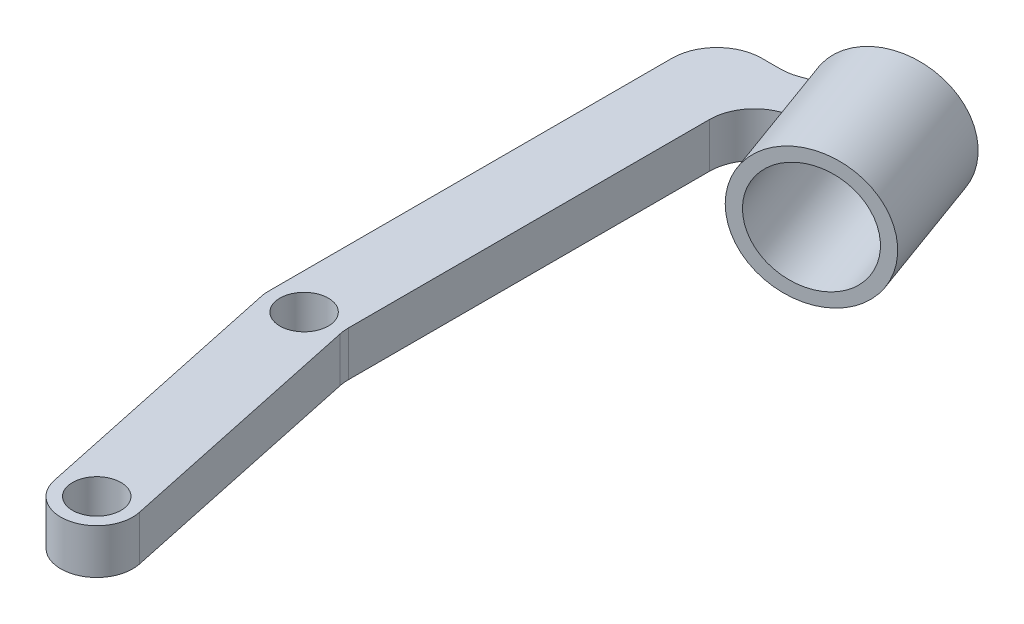
ISO-10303-21;
HEADER;
FILE_DESCRIPTION(('STEP AP214'),'2;1');
FILE_NAME('part.step','',(''),(''),'','','');
FILE_SCHEMA(('AUTOMOTIVE_DESIGN { 1 0 10303 214 1 1 1 1 }'));
ENDSEC;
DATA;
#1=APPLICATION_CONTEXT('core data for automotive mechanical design processes');
#2=APPLICATION_PROTOCOL_DEFINITION('international standard','automotive_design',2000,#1);
#3=PRODUCT_CONTEXT('',#1,'mechanical');
#4=PRODUCT('Part','Part','',(#3));
#5=PRODUCT_RELATED_PRODUCT_CATEGORY('part','',(#4));
#6=PRODUCT_DEFINITION_FORMATION('','',#4);
#7=PRODUCT_DEFINITION_CONTEXT('part definition',#1,'design');
#8=PRODUCT_DEFINITION('design','',#6,#7);
#9=PRODUCT_DEFINITION_SHAPE('','',#8);
#10=(LENGTH_UNIT() NAMED_UNIT(*) SI_UNIT(.MILLI.,.METRE.));
#11=(NAMED_UNIT(*) PLANE_ANGLE_UNIT() SI_UNIT($,.RADIAN.));
#12=(NAMED_UNIT(*) SI_UNIT($,.STERADIAN.) SOLID_ANGLE_UNIT());
#13=UNCERTAINTY_MEASURE_WITH_UNIT(LENGTH_MEASURE(1.E-05),#10,'distance_accuracy_value','');
#14=(GEOMETRIC_REPRESENTATION_CONTEXT(3) GLOBAL_UNCERTAINTY_ASSIGNED_CONTEXT((#13)) GLOBAL_UNIT_ASSIGNED_CONTEXT((#10,
#11,#12)) REPRESENTATION_CONTEXT('',''));
#15=CARTESIAN_POINT('',(0.,0.,0.));
#16=DIRECTION('',(0.,0.,1.));
#17=DIRECTION('',(1.,0.,0.));
#18=AXIS2_PLACEMENT_3D('',#15,#16,#17);
#19=CARTESIAN_POINT('',(-2.23735072453269,5.,-74.0235391596347));
#20=DIRECTION('',(-0.342020143325663,0.,-0.939692620785911));
#21=DIRECTION('',(-0.939692620785911,0.,0.342020143325663));
#22=AXIS2_PLACEMENT_3D('',#19,#20,#21);
#23=PLANE('',#22);
#24=DIRECTION('',(0.,-1.,0.));
#25=VECTOR('',#24,1.);
#26=CARTESIAN_POINT('',(1.05254855883899,0.,-75.2209645725156));
#27=LINE('',#26,#25);
#28=CARTESIAN_POINT('',(1.05254855883899,5.,-75.2209645725156));
#29=VERTEX_POINT('',#28);
#30=CARTESIAN_POINT('',(1.05254855883899,4.24621515844331,-75.2209645725156));
#31=VERTEX_POINT('',#30);
#32=EDGE_CURVE('E276',#29,#31,#27,.T.);
#33=ORIENTED_EDGE('',*,*,#32,.T.);
#34=CARTESIAN_POINT('',(7.90655681000694,2.5,-77.7156195613557));
#35=DIRECTION('',(-0.342020143325663,0.,-0.939692620785911));
#36=DIRECTION('',(-0.939692620785911,0.,0.342020143325663));
#37=AXIS2_PLACEMENT_3D('',#34,#35,#36);
#38=CIRCLE('',#37,7.5);
#39=CARTESIAN_POINT('',(1.26192656612018,5.,-75.297171934876));
#40=VERTEX_POINT('',#39);
#41=EDGE_CURVE('E63',#31,#40,#38,.T.);
#42=ORIENTED_EDGE('',*,*,#41,.T.);
#43=DIRECTION('',(0.939692620785911,0.,-0.342020143325663));
#44=VECTOR('',#43,1.);
#45=CARTESIAN_POINT('',(-2.23735072453269,5.,-74.0235391596347));
#46=LINE('',#45,#44);
#47=EDGE_CURVE('E174',#29,#40,#46,.T.);
#48=ORIENTED_EDGE('',*,*,#47,.F.);
#49=EDGE_LOOP('',(#33,#42,#48));
#50=FACE_BOUND('',#49,.T.);
#51=ADVANCED_FACE('F43',(#50),#23,.F.);
#52=CARTESIAN_POINT('',(-6.23735072453269,5.,-29.3444280220142));
#53=DIRECTION('',(0.,1.,0.));
#54=DIRECTION('',(0.,0.,1.));
#55=AXIS2_PLACEMENT_3D('',#52,#53,#54);
#56=PLANE('',#55);
#57=DIRECTION('',(-0.342020143325663,0.,-0.93969262078591));
#58=VECTOR('',#57,1.);
#59=CARTESIAN_POINT('',(4.68212799937681,5.,-65.9002457270169));
#60=LINE('',#59,#58);
#61=CARTESIAN_POINT('',(-0.448174150508135,5.,-79.9956350388055));
#62=VERTEX_POINT('',#61);
#63=EDGE_CURVE('E157',#62,#40,#60,.F.);
#64=ORIENTED_EDGE('',*,*,#63,.F.);
#65=DIRECTION('',(-0.93969262078591,0.,0.342020143325664));
#66=VECTOR('',#65,1.);
#67=CARTESIAN_POINT('',(11.858038587256,5.,-84.4747301718991));
#68=LINE('',#67,#66);
#69=CARTESIAN_POINT('',(-1.40888491144666,5.,-79.6459649180846));
#70=VERTEX_POINT('',#69);
#71=EDGE_CURVE('E171',#62,#70,#68,.T.);
#72=ORIENTED_EDGE('',*,*,#71,.T.);
#73=CARTESIAN_POINT('',(-3.11898562807498,5.,-84.3444280220142));
#74=DIRECTION('',(0.,1.,0.));
#75=DIRECTION('',(0.,0.,1.));
#76=AXIS2_PLACEMENT_3D('',#73,#74,#75);
#77=CIRCLE('',#76,5.);
#78=CARTESIAN_POINT('',(-3.11898562807498,5.,-79.3444280220142));
#79=VERTEX_POINT('',#78);
#80=EDGE_CURVE('E293',#70,#79,#77,.F.);
#81=ORIENTED_EDGE('',*,*,#80,.T.);
#82=DIRECTION('',(-1.,0.,0.));
#83=VECTOR('',#82,1.);
#84=CARTESIAN_POINT('',(-10.2373507245327,5.,-79.3444280220142));
#85=LINE('',#84,#83);
#86=CARTESIAN_POINT('',(-5.2373507245327,5.,-79.3444280220142));
#87=VERTEX_POINT('',#86);
#88=EDGE_CURVE('E184',#79,#87,#85,.T.);
#89=ORIENTED_EDGE('',*,*,#88,.T.);
#90=CARTESIAN_POINT('',(-5.2373507245327,5.,-74.3444280220142));
#91=DIRECTION('',(0.,1.,0.));
#92=DIRECTION('',(0.,0.,1.));
#93=AXIS2_PLACEMENT_3D('',#90,#91,#92);
#94=CIRCLE('',#93,5.);
#95=CARTESIAN_POINT('',(-10.2373507245327,5.,-74.3444280220142));
#96=VERTEX_POINT('',#95);
#97=EDGE_CURVE('E272',#87,#96,#94,.T.);
#98=ORIENTED_EDGE('',*,*,#97,.T.);
#99=DIRECTION('',(0.,0.,1.));
#100=VECTOR('',#99,1.);
#101=CARTESIAN_POINT('',(-10.2373507245327,5.,-29.3444280220142));
#102=LINE('',#101,#100);
#103=CARTESIAN_POINT('',(-10.2373507245327,5.,-29.3444280220142));
#104=VERTEX_POINT('',#103);
#105=EDGE_CURVE('E189',#96,#104,#102,.T.);
#106=ORIENTED_EDGE('',*,*,#105,.T.);
#107=CARTESIAN_POINT('',(-6.23735072453269,5.,-29.3444280220142));
#108=DIRECTION('',(0.,1.,0.));
#109=DIRECTION('',(0.,0.,1.));
#110=AXIS2_PLACEMENT_3D('',#107,#108,#109);
#111=CIRCLE('',#110,4.);
#112=CARTESIAN_POINT('',(-10.1499411274679,5.,-28.5127812587432));
#113=VERTEX_POINT('',#112);
#114=EDGE_CURVE('E197',#104,#113,#111,.T.);
#115=ORIENTED_EDGE('',*,*,#114,.T.);
#116=DIRECTION('',(0.207911690817756,0.,0.978147600733806));
#117=VECTOR('',#116,1.);
#118=CARTESIAN_POINT('',(-10.1499411274679,5.,-28.5127812587432));
#119=LINE('',#118,#117);
#120=CARTESIAN_POINT('',(-3.91259040293523,5.,0.831646763271024));
#121=VERTEX_POINT('',#120);
#122=EDGE_CURVE('E200',#113,#121,#119,.T.);
#123=ORIENTED_EDGE('',*,*,#122,.T.);
#124=CARTESIAN_POINT('',(0.,5.,0.));
#125=DIRECTION('',(0.,1.,0.));
#126=DIRECTION('',(0.,0.,1.));
#127=AXIS2_PLACEMENT_3D('',#124,#125,#126);
#128=CIRCLE('',#127,4.);
#129=CARTESIAN_POINT('',(3.91259040293522,5.,-0.831646763271026));
#130=VERTEX_POINT('',#129);
#131=EDGE_CURVE('E203',#121,#130,#128,.T.);
#132=ORIENTED_EDGE('',*,*,#131,.T.);
#133=DIRECTION('',(-0.207911690817757,0.,-0.978147600733806));
#134=VECTOR('',#133,1.);
#135=CARTESIAN_POINT('',(3.91259040293522,5.,-0.831646763271026));
#136=LINE('',#135,#134);
#137=CARTESIAN_POINT('',(-2.12808872820172,5.,-29.2508076853165));
#138=VERTEX_POINT('',#137);
#139=EDGE_CURVE('E206',#130,#138,#136,.T.);
#140=ORIENTED_EDGE('',*,*,#139,.T.);
#141=CARTESIAN_POINT('',(2.76264927546731,5.,-30.2903661394053));
#142=DIRECTION('',(0.,1.,0.));
#143=DIRECTION('',(0.,0.,1.));
#144=AXIS2_PLACEMENT_3D('',#141,#142,#143);
#145=CIRCLE('',#144,5.);
#146=CARTESIAN_POINT('',(-2.23735072453269,5.,-30.2903661394053));
#147=VERTEX_POINT('',#146);
#148=EDGE_CURVE('E56',#138,#147,#145,.F.);
#149=ORIENTED_EDGE('',*,*,#148,.T.);
#150=DIRECTION('',(0.,0.,-1.));
#151=VECTOR('',#150,1.);
#152=CARTESIAN_POINT('',(-2.23735072453269,5.,-29.7648449630769));
#153=LINE('',#152,#151);
#154=CARTESIAN_POINT('',(-2.23735072453269,5.,-70.5225014685861));
#155=VERTEX_POINT('',#154);
#156=EDGE_CURVE('E191',#147,#155,#153,.T.);
#157=ORIENTED_EDGE('',*,*,#156,.T.);
#158=CARTESIAN_POINT('',(2.76264927546731,5.,-70.5225014685861));
#159=DIRECTION('',(0.,1.,0.));
#160=DIRECTION('',(0.,0.,1.));
#161=AXIS2_PLACEMENT_3D('',#158,#159,#160);
#162=CIRCLE('',#161,5.);
#163=EDGE_CURVE('E299',#155,#29,#162,.F.);
#164=ORIENTED_EDGE('',*,*,#163,.T.);
#165=ORIENTED_EDGE('',*,*,#47,.T.);
#166=EDGE_LOOP('',(#64,#72,#81,#89,#98,#106,#115,#123,#132,#140,#149,#157,#164,#165));
#167=FACE_BOUND('',#166,.T.);
#168=CARTESIAN_POINT('',(0.,5.,0.));
#169=DIRECTION('',(0.,1.,0.));
#170=DIRECTION('',(0.,0.,1.));
#171=AXIS2_PLACEMENT_3D('',#168,#169,#170);
#172=CIRCLE('',#171,2.7);
#173=CARTESIAN_POINT('',(0.,5.,2.7));
#174=VERTEX_POINT('',#173);
#175=EDGE_CURVE('E215',#174,#174,#172,.T.);
#176=ORIENTED_EDGE('',*,*,#175,.F.);
#177=EDGE_LOOP('',(#176));
#178=FACE_BOUND('',#177,.T.);
#179=CARTESIAN_POINT('',(-6.23735072453269,5.,-29.3444280220142));
#180=DIRECTION('',(0.,1.,0.));
#181=DIRECTION('',(0.,0.,1.));
#182=AXIS2_PLACEMENT_3D('',#179,#180,#181);
#183=CIRCLE('',#182,2.7);
#184=CARTESIAN_POINT('',(-6.23735072453269,5.,-26.6444280220142));
#185=VERTEX_POINT('',#184);
#186=EDGE_CURVE('E372',#185,#185,#183,.T.);
#187=ORIENTED_EDGE('',*,*,#186,.F.);
#188=EDGE_LOOP('',(#187));
#189=FACE_BOUND('',#188,.T.);
#190=ADVANCED_FACE('F169',(#167,#178,#189),#56,.T.);
#191=CARTESIAN_POINT('',(-6.23735072453269,0.,-29.3444280220142));
#192=DIRECTION('',(0.,1.,0.));
#193=DIRECTION('',(0.,0.,1.));
#194=AXIS2_PLACEMENT_3D('',#191,#192,#193);
#195=PLANE('',#194);
#196=DIRECTION('',(-0.93969262078591,0.,0.342020143325664));
#197=VECTOR('',#196,1.);
#198=CARTESIAN_POINT('',(11.858038587256,0.,-84.4747301718991));
#199=LINE('',#198,#197);
#200=CARTESIAN_POINT('',(-0.448174150508135,0.,-79.9956350388055));
#201=VERTEX_POINT('',#200);
#202=CARTESIAN_POINT('',(-1.40888491144666,0.,-79.6459649180846));
#203=VERTEX_POINT('',#202);
#204=EDGE_CURVE('E219',#201,#203,#199,.T.);
#205=ORIENTED_EDGE('',*,*,#204,.F.);
#206=DIRECTION('',(-0.342020143325663,0.,-0.93969262078591));
#207=VECTOR('',#206,1.);
#208=CARTESIAN_POINT('',(4.68212799937681,0.,-65.9002457270169));
#209=LINE('',#208,#207);
#210=CARTESIAN_POINT('',(1.26192656612018,0.,-75.297171934876));
#211=VERTEX_POINT('',#210);
#212=EDGE_CURVE('E159',#201,#211,#209,.F.);
#213=ORIENTED_EDGE('',*,*,#212,.T.);
#214=DIRECTION('',(0.939692620785911,0.,-0.342020143325663));
#215=VECTOR('',#214,1.);
#216=CARTESIAN_POINT('',(-2.23735072453269,0.,-74.0235391596347));
#217=LINE('',#216,#215);
#218=CARTESIAN_POINT('',(1.05254855883899,0.,-75.2209645725156));
#219=VERTEX_POINT('',#218);
#220=EDGE_CURVE('E214',#219,#211,#217,.T.);
#221=ORIENTED_EDGE('',*,*,#220,.F.);
#222=CARTESIAN_POINT('',(2.76264927546731,0.,-70.5225014685861));
#223=DIRECTION('',(0.,1.,0.));
#224=DIRECTION('',(0.,0.,1.));
#225=AXIS2_PLACEMENT_3D('',#222,#223,#224);
#226=CIRCLE('',#225,5.);
#227=CARTESIAN_POINT('',(-2.23735072453269,0.,-70.5225014685861));
#228=VERTEX_POINT('',#227);
#229=EDGE_CURVE('E296',#219,#228,#226,.T.);
#230=ORIENTED_EDGE('',*,*,#229,.T.);
#231=DIRECTION('',(0.,0.,-1.));
#232=VECTOR('',#231,1.);
#233=CARTESIAN_POINT('',(-2.23735072453269,0.,-29.7648449630769));
#234=LINE('',#233,#232);
#235=CARTESIAN_POINT('',(-2.23735072453269,0.,-30.2903661394053));
#236=VERTEX_POINT('',#235);
#237=EDGE_CURVE('E210',#236,#228,#234,.T.);
#238=ORIENTED_EDGE('',*,*,#237,.F.);
#239=CARTESIAN_POINT('',(2.76264927546731,0.,-30.2903661394053));
#240=DIRECTION('',(0.,1.,0.));
#241=DIRECTION('',(0.,0.,1.));
#242=AXIS2_PLACEMENT_3D('',#239,#240,#241);
#243=CIRCLE('',#242,5.);
#244=CARTESIAN_POINT('',(-2.12808872820172,0.,-29.2508076853165));
#245=VERTEX_POINT('',#244);
#246=EDGE_CURVE('E302',#236,#245,#243,.T.);
#247=ORIENTED_EDGE('',*,*,#246,.T.);
#248=DIRECTION('',(-0.207911690817757,0.,-0.978147600733806));
#249=VECTOR('',#248,1.);
#250=CARTESIAN_POINT('',(3.91259040293522,0.,-0.831646763271026));
#251=LINE('',#250,#249);
#252=CARTESIAN_POINT('',(3.91259040293522,0.,-0.831646763271026));
#253=VERTEX_POINT('',#252);
#254=EDGE_CURVE('E238',#253,#245,#251,.T.);
#255=ORIENTED_EDGE('',*,*,#254,.F.);
#256=CARTESIAN_POINT('',(0.,0.,0.));
#257=DIRECTION('',(0.,1.,0.));
#258=DIRECTION('',(0.,0.,1.));
#259=AXIS2_PLACEMENT_3D('',#256,#257,#258);
#260=CIRCLE('',#259,4.);
#261=CARTESIAN_POINT('',(-3.91259040293523,0.,0.831646763271024));
#262=VERTEX_POINT('',#261);
#263=EDGE_CURVE('E235',#262,#253,#260,.T.);
#264=ORIENTED_EDGE('',*,*,#263,.F.);
#265=DIRECTION('',(0.207911690817756,0.,0.978147600733806));
#266=VECTOR('',#265,1.);
#267=CARTESIAN_POINT('',(-10.1499411274679,0.,-28.5127812587432));
#268=LINE('',#267,#266);
#269=CARTESIAN_POINT('',(-10.1499411274679,0.,-28.5127812587432));
#270=VERTEX_POINT('',#269);
#271=EDGE_CURVE('E232',#270,#262,#268,.T.);
#272=ORIENTED_EDGE('',*,*,#271,.F.);
#273=CARTESIAN_POINT('',(-6.23735072453269,0.,-29.3444280220142));
#274=DIRECTION('',(0.,1.,0.));
#275=DIRECTION('',(0.,0.,1.));
#276=AXIS2_PLACEMENT_3D('',#273,#274,#275);
#277=CIRCLE('',#276,4.);
#278=CARTESIAN_POINT('',(-10.2373507245327,0.,-29.3444280220142));
#279=VERTEX_POINT('',#278);
#280=EDGE_CURVE('E229',#279,#270,#277,.T.);
#281=ORIENTED_EDGE('',*,*,#280,.F.);
#282=DIRECTION('',(0.,0.,1.));
#283=VECTOR('',#282,1.);
#284=CARTESIAN_POINT('',(-10.2373507245327,0.,-29.3444280220142));
#285=LINE('',#284,#283);
#286=CARTESIAN_POINT('',(-10.2373507245327,0.,-74.3444280220142));
#287=VERTEX_POINT('',#286);
#288=EDGE_CURVE('E226',#287,#279,#285,.T.);
#289=ORIENTED_EDGE('',*,*,#288,.F.);
#290=CARTESIAN_POINT('',(-5.2373507245327,0.,-74.3444280220142));
#291=DIRECTION('',(0.,1.,0.));
#292=DIRECTION('',(0.,0.,1.));
#293=AXIS2_PLACEMENT_3D('',#290,#291,#292);
#294=CIRCLE('',#293,5.);
#295=CARTESIAN_POINT('',(-5.2373507245327,0.,-79.3444280220142));
#296=VERTEX_POINT('',#295);
#297=EDGE_CURVE('E269',#287,#296,#294,.F.);
#298=ORIENTED_EDGE('',*,*,#297,.T.);
#299=DIRECTION('',(-1.,0.,0.));
#300=VECTOR('',#299,1.);
#301=CARTESIAN_POINT('',(-10.2373507245327,0.,-79.3444280220142));
#302=LINE('',#301,#300);
#303=CARTESIAN_POINT('',(-3.11898562807498,0.,-79.3444280220142));
#304=VERTEX_POINT('',#303);
#305=EDGE_CURVE('E222',#304,#296,#302,.T.);
#306=ORIENTED_EDGE('',*,*,#305,.F.);
#307=CARTESIAN_POINT('',(-3.11898562807498,0.,-84.3444280220142));
#308=DIRECTION('',(0.,1.,0.));
#309=DIRECTION('',(0.,0.,1.));
#310=AXIS2_PLACEMENT_3D('',#307,#308,#309);
#311=CIRCLE('',#310,5.);
#312=EDGE_CURVE('E289',#304,#203,#311,.T.);
#313=ORIENTED_EDGE('',*,*,#312,.T.);
#314=EDGE_LOOP('',(#205,#213,#221,#230,#238,#247,#255,#264,#272,#281,#289,#298,#306,#313));
#315=FACE_BOUND('',#314,.T.);
#316=CARTESIAN_POINT('',(0.,0.,0.));
#317=DIRECTION('',(0.,1.,0.));
#318=DIRECTION('',(0.,0.,1.));
#319=AXIS2_PLACEMENT_3D('',#316,#317,#318);
#320=CIRCLE('',#319,2.7);
#321=CARTESIAN_POINT('',(0.,0.,2.7));
#322=VERTEX_POINT('',#321);
#323=EDGE_CURVE('E376',#322,#322,#320,.T.);
#324=ORIENTED_EDGE('',*,*,#323,.T.);
#325=EDGE_LOOP('',(#324));
#326=FACE_BOUND('',#325,.T.);
#327=CARTESIAN_POINT('',(-6.23735072453269,0.,-29.3444280220142));
#328=DIRECTION('',(0.,1.,0.));
#329=DIRECTION('',(0.,0.,1.));
#330=AXIS2_PLACEMENT_3D('',#327,#328,#329);
#331=CIRCLE('',#330,2.7);
#332=CARTESIAN_POINT('',(-6.23735072453269,0.,-26.6444280220142));
#333=VERTEX_POINT('',#332);
#334=EDGE_CURVE('E176',#333,#333,#331,.T.);
#335=ORIENTED_EDGE('',*,*,#334,.T.);
#336=EDGE_LOOP('',(#335));
#337=FACE_BOUND('',#336,.T.);
#338=ADVANCED_FACE('F318',(#315,#326,#337),#195,.F.);
#339=CARTESIAN_POINT('',(-2.23735072453269,5.,-29.7648449630769));
#340=DIRECTION('',(-1.,0.,0.));
#341=DIRECTION('',(0.,0.,1.));
#342=AXIS2_PLACEMENT_3D('',#339,#340,#341);
#343=PLANE('',#342);
#344=ORIENTED_EDGE('',*,*,#237,.T.);
#345=DIRECTION('',(0.,-1.,0.));
#346=VECTOR('',#345,1.);
#347=CARTESIAN_POINT('',(-2.23735072453269,5.,-70.5225014685861));
#348=LINE('',#347,#346);
#349=EDGE_CURVE('E284',#228,#155,#348,.F.);
#350=ORIENTED_EDGE('',*,*,#349,.T.);
#351=ORIENTED_EDGE('',*,*,#156,.F.);
#352=DIRECTION('',(0.,-1.,0.));
#353=VECTOR('',#352,1.);
#354=CARTESIAN_POINT('',(-2.23735072453269,0.,-30.2903661394053));
#355=LINE('',#354,#353);
#356=EDGE_CURVE('E280',#147,#236,#355,.T.);
#357=ORIENTED_EDGE('',*,*,#356,.T.);
#358=EDGE_LOOP('',(#344,#350,#351,#357));
#359=FACE_BOUND('',#358,.T.);
#360=ADVANCED_FACE('F312',(#359),#343,.F.);
#361=ORIENTED_EDGE('',*,*,#220,.T.);
#362=CARTESIAN_POINT('',(1.05254855883899,0.753784841556688,-75.2209645725156));
#363=VERTEX_POINT('',#362);
#364=EDGE_CURVE('E359',#211,#363,#38,.T.);
#365=ORIENTED_EDGE('',*,*,#364,.T.);
#366=EDGE_CURVE('E275',#363,#219,#27,.T.);
#367=ORIENTED_EDGE('',*,*,#366,.T.);
#368=EDGE_LOOP('',(#361,#365,#367));
#369=FACE_BOUND('',#368,.T.);
#370=ADVANCED_FACE('F358',(#369),#23,.F.);
#371=CARTESIAN_POINT('',(11.858038587256,5.,-84.4747301718991));
#372=DIRECTION('',(0.342020143325664,0.,0.93969262078591));
#373=DIRECTION('',(0.93969262078591,0.,-0.342020143325664));
#374=AXIS2_PLACEMENT_3D('',#371,#372,#373);
#375=PLANE('',#374);
#376=ORIENTED_EDGE('',*,*,#71,.F.);
#377=CARTESIAN_POINT('',(6.19645609337863,2.5,-82.4140826652852));
#378=DIRECTION('',(-0.342020143325663,0.,-0.939692620785911));
#379=DIRECTION('',(-0.939692620785911,0.,0.342020143325663));
#380=AXIS2_PLACEMENT_3D('',#377,#378,#379);
#381=CIRCLE('',#380,7.5);
#382=EDGE_CURVE('E154',#62,#201,#381,.T.);
#383=ORIENTED_EDGE('',*,*,#382,.T.);
#384=ORIENTED_EDGE('',*,*,#204,.T.);
#385=DIRECTION('',(0.,-1.,0.));
#386=VECTOR('',#385,1.);
#387=CARTESIAN_POINT('',(-1.40888491144666,5.,-79.6459649180846));
#388=LINE('',#387,#386);
#389=EDGE_CURVE('E181',#203,#70,#388,.F.);
#390=ORIENTED_EDGE('',*,*,#389,.T.);
#391=EDGE_LOOP('',(#376,#383,#384,#390));
#392=FACE_BOUND('',#391,.T.);
#393=CARTESIAN_POINT('',(6.19645609337863,2.5,-82.4140826652852));
#394=DIRECTION('',(-0.342020143325663,0.,-0.939692620785911));
#395=DIRECTION('',(-0.939692620785911,0.,0.342020143325663));
#396=AXIS2_PLACEMENT_3D('',#393,#394,#395);
#397=CIRCLE('',#396,5.99999999999999);
#398=CARTESIAN_POINT('',(0.558300368663173,2.5,-80.3619618053312));
#399=VERTEX_POINT('',#398);
#400=EDGE_CURVE('E447',#399,#399,#397,.T.);
#401=ORIENTED_EDGE('',*,*,#400,.F.);
#402=EDGE_LOOP('',(#401));
#403=FACE_BOUND('',#402,.T.);
#404=ADVANCED_FACE('F178',(#392,#403),#375,.F.);
#405=CARTESIAN_POINT('',(-10.2373507245327,5.,-79.3444280220142));
#406=DIRECTION('',(0.,0.,1.));
#407=DIRECTION('',(1.,0.,0.));
#408=AXIS2_PLACEMENT_3D('',#405,#406,#407);
#409=PLANE('',#408);
#410=ORIENTED_EDGE('',*,*,#88,.F.);
#411=DIRECTION('',(0.,-1.,0.));
#412=VECTOR('',#411,1.);
#413=CARTESIAN_POINT('',(-3.11898562807498,0.,-79.3444280220142));
#414=LINE('',#413,#412);
#415=EDGE_CURVE('E259',#79,#304,#414,.T.);
#416=ORIENTED_EDGE('',*,*,#415,.T.);
#417=ORIENTED_EDGE('',*,*,#305,.T.);
#418=DIRECTION('',(0.,-1.,0.));
#419=VECTOR('',#418,1.);
#420=CARTESIAN_POINT('',(-5.2373507245327,5.,-79.3444280220142));
#421=LINE('',#420,#419);
#422=EDGE_CURVE('E256',#296,#87,#421,.F.);
#423=ORIENTED_EDGE('',*,*,#422,.T.);
#424=EDGE_LOOP('',(#410,#416,#417,#423));
#425=FACE_BOUND('',#424,.T.);
#426=ADVANCED_FACE('F347',(#425),#409,.F.);
#427=CARTESIAN_POINT('',(-10.2373507245327,5.,-29.3444280220142));
#428=DIRECTION('',(1.,0.,0.));
#429=DIRECTION('',(0.,0.,-1.));
#430=AXIS2_PLACEMENT_3D('',#427,#428,#429);
#431=PLANE('',#430);
#432=ORIENTED_EDGE('',*,*,#105,.F.);
#433=DIRECTION('',(0.,-1.,0.));
#434=VECTOR('',#433,1.);
#435=CARTESIAN_POINT('',(-10.2373507245327,5.,-74.3444280220142));
#436=LINE('',#435,#434);
#437=EDGE_CURVE('E265',#96,#287,#436,.T.);
#438=ORIENTED_EDGE('',*,*,#437,.T.);
#439=ORIENTED_EDGE('',*,*,#288,.T.);
#440=DIRECTION('',(0.,-1.,0.));
#441=VECTOR('',#440,1.);
#442=CARTESIAN_POINT('',(-10.2373507245327,5.,-29.3444280220142));
#443=LINE('',#442,#441);
#444=EDGE_CURVE('E252',#104,#279,#443,.T.);
#445=ORIENTED_EDGE('',*,*,#444,.F.);
#446=EDGE_LOOP('',(#432,#438,#439,#445));
#447=FACE_BOUND('',#446,.T.);
#448=ADVANCED_FACE('F340',(#447),#431,.F.);
#449=CARTESIAN_POINT('',(-6.23735072453269,5.,-29.3444280220142));
#450=DIRECTION('',(0.,-1.,0.));
#451=DIRECTION('',(0.,0.,-1.));
#452=AXIS2_PLACEMENT_3D('',#449,#450,#451);
#453=CYLINDRICAL_SURFACE('',#452,4.);
#454=ORIENTED_EDGE('',*,*,#280,.T.);
#455=DIRECTION('',(0.,-1.,0.));
#456=VECTOR('',#455,1.);
#457=CARTESIAN_POINT('',(-10.1499411274679,5.,-28.5127812587432));
#458=LINE('',#457,#456);
#459=EDGE_CURVE('E248',#113,#270,#458,.T.);
#460=ORIENTED_EDGE('',*,*,#459,.F.);
#461=ORIENTED_EDGE('',*,*,#114,.F.);
#462=ORIENTED_EDGE('',*,*,#444,.T.);
#463=EDGE_LOOP('',(#454,#460,#461,#462));
#464=FACE_BOUND('',#463,.T.);
#465=ADVANCED_FACE('F336',(#464),#453,.T.);
#466=CARTESIAN_POINT('',(-10.1499411274679,5.,-28.5127812587432));
#467=DIRECTION('',(0.978147600733806,0.,-0.207911690817756));
#468=DIRECTION('',(-0.207911690817756,0.,-0.978147600733806));
#469=AXIS2_PLACEMENT_3D('',#466,#467,#468);
#470=PLANE('',#469);
#471=ORIENTED_EDGE('',*,*,#271,.T.);
#472=DIRECTION('',(0.,-1.,0.));
#473=VECTOR('',#472,1.);
#474=CARTESIAN_POINT('',(-3.91259040293523,5.,0.831646763271024));
#475=LINE('',#474,#473);
#476=EDGE_CURVE('E244',#121,#262,#475,.T.);
#477=ORIENTED_EDGE('',*,*,#476,.F.);
#478=ORIENTED_EDGE('',*,*,#122,.F.);
#479=ORIENTED_EDGE('',*,*,#459,.T.);
#480=EDGE_LOOP('',(#471,#477,#478,#479));
#481=FACE_BOUND('',#480,.T.);
#482=ADVANCED_FACE('F331',(#481),#470,.F.);
#483=CARTESIAN_POINT('',(0.,5.,0.));
#484=DIRECTION('',(0.,-1.,0.));
#485=DIRECTION('',(0.,0.,-1.));
#486=AXIS2_PLACEMENT_3D('',#483,#484,#485);
#487=CYLINDRICAL_SURFACE('',#486,4.);
#488=ORIENTED_EDGE('',*,*,#263,.T.);
#489=DIRECTION('',(0.,-1.,0.));
#490=VECTOR('',#489,1.);
#491=CARTESIAN_POINT('',(3.91259040293522,5.,-0.831646763271026));
#492=LINE('',#491,#490);
#493=EDGE_CURVE('E209',#130,#253,#492,.T.);
#494=ORIENTED_EDGE('',*,*,#493,.F.);
#495=ORIENTED_EDGE('',*,*,#131,.F.);
#496=ORIENTED_EDGE('',*,*,#476,.T.);
#497=EDGE_LOOP('',(#488,#494,#495,#496));
#498=FACE_BOUND('',#497,.T.);
#499=ADVANCED_FACE('F325',(#498),#487,.T.);
#500=CARTESIAN_POINT('',(3.91259040293522,5.,-0.831646763271026));
#501=DIRECTION('',(-0.978147600733806,0.,0.207911690817757));
#502=DIRECTION('',(0.207911690817757,0.,0.978147600733806));
#503=AXIS2_PLACEMENT_3D('',#500,#501,#502);
#504=PLANE('',#503);
#505=ORIENTED_EDGE('',*,*,#254,.T.);
#506=DIRECTION('',(0.,-1.,0.));
#507=VECTOR('',#506,1.);
#508=CARTESIAN_POINT('',(-2.12808872820172,5.,-29.2508076853165));
#509=LINE('',#508,#507);
#510=EDGE_CURVE('E70',#245,#138,#509,.F.);
#511=ORIENTED_EDGE('',*,*,#510,.T.);
#512=ORIENTED_EDGE('',*,*,#139,.F.);
#513=ORIENTED_EDGE('',*,*,#493,.T.);
#514=EDGE_LOOP('',(#505,#511,#512,#513));
#515=FACE_BOUND('',#514,.T.);
#516=ADVANCED_FACE('F321',(#515),#504,.F.);
#517=CARTESIAN_POINT('',(0.,5.,0.));
#518=DIRECTION('',(0.,-1.,0.));
#519=DIRECTION('',(0.,0.,-1.));
#520=AXIS2_PLACEMENT_3D('',#517,#518,#519);
#521=CYLINDRICAL_SURFACE('',#520,2.7);
#522=ORIENTED_EDGE('',*,*,#175,.T.);
#523=EDGE_LOOP('',(#522));
#524=FACE_BOUND('',#523,.T.);
#525=ORIENTED_EDGE('',*,*,#323,.F.);
#526=EDGE_LOOP('',(#525));
#527=FACE_BOUND('',#526,.T.);
#528=ADVANCED_FACE('F388',(#524,#527),#521,.F.);
#529=CARTESIAN_POINT('',(-6.23735072453269,5.,-29.3444280220142));
#530=DIRECTION('',(0.,-1.,0.));
#531=DIRECTION('',(0.,0.,-1.));
#532=AXIS2_PLACEMENT_3D('',#529,#530,#531);
#533=CYLINDRICAL_SURFACE('',#532,2.7);
#534=ORIENTED_EDGE('',*,*,#186,.T.);
#535=EDGE_LOOP('',(#534));
#536=FACE_BOUND('',#535,.T.);
#537=ORIENTED_EDGE('',*,*,#334,.F.);
#538=EDGE_LOOP('',(#537));
#539=FACE_BOUND('',#538,.T.);
#540=ADVANCED_FACE('F390',(#536,#539),#533,.F.);
#541=CARTESIAN_POINT('',(-3.11898562807498,5.,-84.3444280220142));
#542=DIRECTION('',(0.,1.,0.));
#543=DIRECTION('',(0.,0.,1.));
#544=AXIS2_PLACEMENT_3D('',#541,#542,#543);
#545=CYLINDRICAL_SURFACE('',#544,5.);
#546=ORIENTED_EDGE('',*,*,#80,.F.);
#547=ORIENTED_EDGE('',*,*,#389,.F.);
#548=ORIENTED_EDGE('',*,*,#312,.F.);
#549=ORIENTED_EDGE('',*,*,#415,.F.);
#550=EDGE_LOOP('',(#546,#547,#548,#549));
#551=FACE_BOUND('',#550,.T.);
#552=ADVANCED_FACE('F352',(#551),#545,.F.);
#553=CARTESIAN_POINT('',(-5.2373507245327,5.,-74.3444280220142));
#554=DIRECTION('',(0.,-1.,0.));
#555=DIRECTION('',(0.,0.,-1.));
#556=AXIS2_PLACEMENT_3D('',#553,#554,#555);
#557=CYLINDRICAL_SURFACE('',#556,5.);
#558=ORIENTED_EDGE('',*,*,#97,.F.);
#559=ORIENTED_EDGE('',*,*,#422,.F.);
#560=ORIENTED_EDGE('',*,*,#297,.F.);
#561=ORIENTED_EDGE('',*,*,#437,.F.);
#562=EDGE_LOOP('',(#558,#559,#560,#561));
#563=FACE_BOUND('',#562,.T.);
#564=ADVANCED_FACE('F350',(#563),#557,.T.);
#565=CARTESIAN_POINT('',(2.76264927546731,5.,-70.5225014685861));
#566=DIRECTION('',(0.,1.,0.));
#567=DIRECTION('',(0.,0.,1.));
#568=AXIS2_PLACEMENT_3D('',#565,#566,#567);
#569=CYLINDRICAL_SURFACE('',#568,5.);
#570=ORIENTED_EDGE('',*,*,#366,.F.);
#571=CARTESIAN_POINT('',(4.47274999209562,4.2462151584433,-65.8240383646565));
#572=CARTESIAN_POINT('',(4.42633928429851,4.03991208954966,-65.8071444198661));
#573=CARTESIAN_POINT('',(4.38791073661049,3.83149770586757,-65.7939145573311));
#574=CARTESIAN_POINT('',(4.32773691391998,3.41189550174173,-65.7736587374092));
#575=CARTESIAN_POINT('',(4.30599869252308,3.20070654702517,-65.7666354028137));
#576=CARTESIAN_POINT('',(4.27961267483893,2.77675765593589,-65.7581529635358));
#577=CARTESIAN_POINT('',(4.27499652143398,2.56399553828718,-65.7567041608275));
#578=CARTESIAN_POINT('',(4.28303071047035,2.13885721020393,-65.7592612201));
#579=CARTESIAN_POINT('',(4.29567890963892,1.92648095514397,-65.7632664049985));
#580=CARTESIAN_POINT('',(4.33782754523494,1.50532338712707,-65.777051177026));
#581=CARTESIAN_POINT('',(4.36719180081667,1.29652690054684,-65.7867841231327));
#582=CARTESIAN_POINT('',(4.44213076375631,0.882260409054083,-65.8128397174641));
#583=CARTESIAN_POINT('',(4.4877068146392,0.676790681317,-65.8291629118595));
#584=CARTESIAN_POINT('',(4.59420662229813,0.270741988760659,-65.8696915910499));
#585=CARTESIAN_POINT('',(4.65512469468361,0.0701612426419573,-65.8938941574193));
#586=CARTESIAN_POINT('',(4.79117129669807,-0.324683317462052,-65.9518816885607));
#587=CARTESIAN_POINT('',(4.86629718364883,-0.518948298328389,-65.9856648719041));
#588=CARTESIAN_POINT('',(5.01511497566354,-0.866569736059484,-66.0579755883072));
#589=CARTESIAN_POINT('',(5.08679318981612,-1.02117490214357,-66.0946623393604));
#590=CARTESIAN_POINT('',(5.23776765631195,-1.3240702526625,-66.1772521207089));
#591=CARTESIAN_POINT('',(5.31706258927792,-1.47236152439786,-66.2231535563213));
#592=CARTESIAN_POINT('',(5.48186045117249,-1.7614408038242,-66.3254451552333));
#593=CARTESIAN_POINT('',(5.56735509507659,-1.9022384045732,-66.3818214722913));
#594=CARTESIAN_POINT('',(5.74302132186793,-2.17543445769859,-66.5064128586418));
#595=CARTESIAN_POINT('',(5.83319185997384,-2.30783477179116,-66.5746252911973));
#596=CARTESIAN_POINT('',(5.99788048609715,-2.53753064244071,-66.7090776337091));
#597=CARTESIAN_POINT('',(6.07191635588421,-2.63654598504754,-66.7729762558534));
#598=CARTESIAN_POINT('',(6.2204994609609,-2.82790428917104,-66.909545855095));
#599=CARTESIAN_POINT('',(6.29504657506088,-2.92024877595487,-66.9822148166725));
#600=CARTESIAN_POINT('',(6.44328430693699,-3.0977124138842,-67.1365940287732));
#601=CARTESIAN_POINT('',(6.51697529178724,-3.18283476830485,-67.2183002335175));
#602=CARTESIAN_POINT('',(6.6620652912366,-3.34545872060836,-67.3908474451665));
#603=CARTESIAN_POINT('',(6.73346428295837,-3.42296024244038,-67.4816885432131));
#604=CARTESIAN_POINT('',(6.87283342073016,-3.57046083375666,-67.6728599868224));
#605=CARTESIAN_POINT('',(6.94078111714346,-3.64041346526398,-67.7732426317712));
#606=CARTESIAN_POINT('',(7.07122944045494,-3.77215730425593,-67.9825524897595));
#607=CARTESIAN_POINT('',(7.13373000026224,-3.83394841122215,-68.0914798080101));
#608=CARTESIAN_POINT('',(7.25179811839163,-3.94943316846276,-68.3171094281083));
#609=CARTESIAN_POINT('',(7.30736570329879,-4.00312684978755,-68.4338117001395));
#610=CARTESIAN_POINT('',(7.4102389561136,-4.10268066902007,-68.6739957365548));
#611=CARTESIAN_POINT('',(7.45754519035595,-4.14854134389377,-68.7974770354575));
#612=CARTESIAN_POINT('',(7.53869501667808,-4.22882326143104,-69.0379424435943));
#613=CARTESIAN_POINT('',(7.57339454227762,-4.26391973312682,-69.1544142631686));
#614=CARTESIAN_POINT('',(7.63448953612641,-4.32849497808326,-69.3910812217539));
#615=CARTESIAN_POINT('',(7.66088217448896,-4.35797183557844,-69.5112776143215));
#616=CARTESIAN_POINT('',(7.70483744891984,-4.41174053150315,-69.7543678217368));
#617=CARTESIAN_POINT('',(7.72240287374687,-4.43603400610797,-69.8772607718463));
#618=CARTESIAN_POINT('',(7.74836952754364,-4.47992556427339,-70.1248855621488));
#619=CARTESIAN_POINT('',(7.7567672746596,-4.4995218616579,-70.249618082789));
#620=CARTESIAN_POINT('',(7.76419885000014,-4.5346096283243,-70.5010534442478));
#621=CARTESIAN_POINT('',(7.76314971333707,-4.55006349871062,-70.6277639666664));
#622=CARTESIAN_POINT('',(7.75138031822604,-4.57705366322944,-70.8811941720104));
#623=CARTESIAN_POINT('',(7.7406567552647,-4.58858861691625,-71.0079138432713));
#624=CARTESIAN_POINT('',(7.7095316730436,-4.60807359440419,-71.260429162224));
#625=CARTESIAN_POINT('',(7.68913062441215,-4.61602379249984,-71.3862248545479));
#626=CARTESIAN_POINT('',(7.63873873539768,-4.62859262506348,-71.6360503291934));
#627=CARTESIAN_POINT('',(7.60874765463127,-4.63321117601108,-71.7600800671683));
#628=CARTESIAN_POINT('',(7.53803681430368,-4.63938491982723,-72.010180971287));
#629=CARTESIAN_POINT('',(7.49695552504467,-4.64081818687919,-72.1361530892038));
#630=CARTESIAN_POINT('',(7.40494172579097,-4.64031636812381,-72.3843925138471));
#631=CARTESIAN_POINT('',(7.35401236469017,-4.63838235741636,-72.506660990387));
#632=CARTESIAN_POINT('',(7.24263034602376,-4.63107520277562,-72.7467519956156));
#633=CARTESIAN_POINT('',(7.18217278893034,-4.62570028510311,-72.8645721980908));
#634=CARTESIAN_POINT('',(7.05223583891734,-4.61132063039194,-73.0948382996026));
#635=CARTESIAN_POINT('',(6.98275988234129,-4.6023172731866,-73.2072862234624));
#636=CARTESIAN_POINT('',(6.83462289866177,-4.58027266746403,-73.4271120893178));
#637=CARTESIAN_POINT('',(6.7558809540118,-4.56719390615142,-73.5344317825687));
#638=CARTESIAN_POINT('',(6.59046738873859,-4.53661996057626,-73.7420380892405));
#639=CARTESIAN_POINT('',(6.50379892691242,-4.51912653075626,-73.8423274764062));
#640=CARTESIAN_POINT('',(6.32331797429593,-4.47922855871569,-74.0352041858943));
#641=CARTESIAN_POINT('',(6.22950572941688,-4.45682418549526,-74.1277917731073));
#642=CARTESIAN_POINT('',(6.03568312018433,-4.40656235927352,-74.3046247007562));
#643=CARTESIAN_POINT('',(5.93567295822209,-4.37870508427114,-74.3888703133639));
#644=CARTESIAN_POINT('',(5.73313744156298,-4.31776497121574,-74.5464604319287));
#645=CARTESIAN_POINT('',(5.63073947063657,-4.28483193792605,-74.6200265777163));
#646=CARTESIAN_POINT('',(5.4222279310285,-4.21277842681888,-74.7583356506873));
#647=CARTESIAN_POINT('',(5.31611444707492,-4.17365809002442,-74.8230787789054));
#648=CARTESIAN_POINT('',(5.10145898769414,-4.08883773976184,-74.9434863155441));
#649=CARTESIAN_POINT('',(4.99291802886949,-4.04314043864131,-74.9991544464192));
#650=CARTESIAN_POINT('',(4.77468064849675,-3.94485548848096,-75.1013931810296));
#651=CARTESIAN_POINT('',(4.66498425590731,-3.89226801175371,-75.1479640122018));
#652=CARTESIAN_POINT('',(4.44972669508146,-3.78206958568153,-75.2306414613163));
#653=CARTESIAN_POINT('',(4.34415907696688,-3.72470822303137,-75.2670649096166));
#654=CARTESIAN_POINT('',(4.13430653765035,-3.60340247141954,-75.3319321817214));
#655=CARTESIAN_POINT('',(4.03002215766712,-3.53945540467451,-75.3603727419903));
#656=CARTESIAN_POINT('',(3.82385863150144,-3.40511756736689,-75.4097371231227));
#657=CARTESIAN_POINT('',(3.72197953510112,-3.33472666358307,-75.4306607885363));
#658=CARTESIAN_POINT('',(3.5216155181179,-3.18776057989515,-75.465608926606));
#659=CARTESIAN_POINT('',(3.42312955956215,-3.11118731559698,-75.479635526841));
#660=CARTESIAN_POINT('',(3.2261744361047,-2.94873815998069,-75.5019980912703));
#661=CARTESIAN_POINT('',(3.12788803180662,-2.8626038595435,-75.5100634733706));
#662=CARTESIAN_POINT('',(2.93657378652896,-2.68437415766191,-75.5203940339403));
#663=CARTESIAN_POINT('',(2.84354597532463,-2.59227872247064,-75.5226591795709));
#664=CARTESIAN_POINT('',(2.66323494090779,-2.40254024758749,-75.5223266126999));
#665=CARTESIAN_POINT('',(2.57595524028677,-2.3048938731788,-75.519725946487));
#666=CARTESIAN_POINT('',(2.40757263865171,-2.10458068157605,-75.5105904329908));
#667=CARTESIAN_POINT('',(2.32647088922391,-2.00191293421304,-75.5040548542412));
#668=CARTESIAN_POINT('',(2.13580024012639,-1.74500626944872,-75.4843483254666));
#669=CARTESIAN_POINT('',(2.02975304866698,-1.58826705144234,-75.4695164892099));
#670=CARTESIAN_POINT('',(1.83152350306667,-1.26661896659423,-75.4360660860967));
#671=CARTESIAN_POINT('',(1.73934613778698,-1.10170718836864,-75.4174461623337));
#672=CARTESIAN_POINT('',(1.56884145629758,-0.764787183418092,-75.3786807623671));
#673=CARTESIAN_POINT('',(1.490532406382,-0.592769960120244,-75.3585333233592));
#674=CARTESIAN_POINT('',(1.34783698530984,-0.243032606245704,-75.3187285229711));
#675=CARTESIAN_POINT('',(1.28344946460334,-0.0653129479320173,-75.2990711212454));
#676=CARTESIAN_POINT('',(1.16765319012333,0.297190909802802,-75.2616724770459));
#677=CARTESIAN_POINT('',(1.11643294055246,0.482038328647234,-75.2439609441235));
#678=CARTESIAN_POINT('',(1.02796819797191,0.855352673076669,-75.2121807492124));
#679=CARTESIAN_POINT('',(0.990723808741844,1.04381962552808,-75.1981121142748));
#680=CARTESIAN_POINT('',(0.930093967304535,1.42314457355769,-75.1746836133485));
#681=CARTESIAN_POINT('',(0.906700317069437,1.61400108634042,-75.1653209624609));
#682=CARTESIAN_POINT('',(0.873647524946439,1.99709074751214,-75.1519710226115));
#683=CARTESIAN_POINT('',(0.863988959573345,2.18932395334593,-75.1479839592844));
#684=CARTESIAN_POINT('',(0.858107745141917,2.5920306389249,-75.1455679267794));
#685=CARTESIAN_POINT('',(0.863226205826729,2.80252855247231,-75.1476936665166));
#686=CARTESIAN_POINT('',(0.889869638508534,3.22232306363824,-75.1585449734042));
#687=CARTESIAN_POINT('',(0.911395855384499,3.43161956889022,-75.1672710413301));
#688=CARTESIAN_POINT('',(0.970991892399133,3.84777759144539,-75.190583279349));
#689=CARTESIAN_POINT('',(1.00908193702362,4.05463581344388,-75.2051766117416));
#690=CARTESIAN_POINT('',(1.10197630010614,4.46418337551042,-75.2389200626452));
#691=CARTESIAN_POINT('',(1.15678021035823,4.66687281726435,-75.2580700698652));
#692=CARTESIAN_POINT('',(1.28354594566595,5.06735123531032,-75.2991852488403));
#693=CARTESIAN_POINT('',(1.35556954493099,5.26511967103045,-75.3211604213336));
#694=CARTESIAN_POINT('',(1.51688932727881,5.65348778183409,-75.3655457698496));
#695=CARTESIAN_POINT('',(1.60618781509687,5.84408649630939,-75.3879560035567));
#696=CARTESIAN_POINT('',(1.80195835876232,6.21609705411261,-75.4303608982586));
#697=CARTESIAN_POINT('',(1.90839764869028,6.397525574419,-75.4503600431556));
#698=CARTESIAN_POINT('',(2.13836851327525,6.74974583508646,-75.4847360186911));
#699=CARTESIAN_POINT('',(2.2618915134093,6.92054284955684,-75.4991156560637));
#700=CARTESIAN_POINT('',(2.48390306334848,7.19788539422585,-75.5155462758819));
#701=CARTESIAN_POINT('',(2.57807088340512,7.30776379932322,-75.5200508490241));
#702=CARTESIAN_POINT('',(2.77363650339337,7.52096169034233,-75.5234452803583));
#703=CARTESIAN_POINT('',(2.87503229310736,7.62428298491061,-75.5223366937025));
#704=CARTESIAN_POINT('',(3.08431351428135,7.82366469042178,-75.5132419521474));
#705=CARTESIAN_POINT('',(3.19219401923963,7.91973049130062,-75.505260958363));
#706=CARTESIAN_POINT('',(3.41357194921715,8.10409435291956,-75.4812001295161));
#707=CARTESIAN_POINT('',(3.52706949583347,8.19239224538583,-75.4651201190578));
#708=CARTESIAN_POINT('',(3.75934769272354,8.36137344313782,-75.4235844539582));
#709=CARTESIAN_POINT('',(3.87816244202331,8.44199250354147,-75.3980571765884));
#710=CARTESIAN_POINT('',(4.1187201704707,8.59449220938092,-75.3366966463721));
#711=CARTESIAN_POINT('',(4.24046316900203,8.66637279695285,-75.3008633252872));
#712=CARTESIAN_POINT('',(4.48511178648624,8.80125222944529,-75.2182216748561));
#713=CARTESIAN_POINT('',(4.60801716654808,8.86425285878027,-75.1714155555267));
#714=CARTESIAN_POINT('',(4.85315349551373,8.98149700537024,-75.0664602039759));
#715=CARTESIAN_POINT('',(4.9753845127556,9.0357414263046,-75.0083121436627));
#716=CARTESIAN_POINT('',(5.20278602895544,9.1298138641009,-74.8883035811089));
#717=CARTESIAN_POINT('',(5.30824410236577,9.17059067972467,-74.827725272075));
#718=CARTESIAN_POINT('',(5.51598861488101,9.24599585615698,-74.6979201349484));
#719=CARTESIAN_POINT('',(5.61827511192728,9.28062432934396,-74.6286934649683));
#720=CARTESIAN_POINT('',(5.81855104145464,9.34417020621846,-74.48190563155));
#721=CARTESIAN_POINT('',(5.91654033340954,9.37308742324602,-74.404344195836));
#722=CARTESIAN_POINT('',(6.10721035566517,9.42569268903718,-74.2413244890411));
#723=CARTESIAN_POINT('',(6.19989095657868,9.44938061038876,-74.1558660256209));
#724=CARTESIAN_POINT('',(6.37794510936902,9.49175056931363,-73.9786867548877));
#725=CARTESIAN_POINT('',(6.46339463097187,9.51049069643657,-73.8870560943419));
#726=CARTESIAN_POINT('',(6.62752838526348,9.54379277257312,-73.6971613562309));
#727=CARTESIAN_POINT('',(6.70621034671372,9.55835332269496,-73.5988950713038));
#728=CARTESIAN_POINT('',(6.85611962192991,9.58367507132097,-73.3964125633152));
#729=CARTESIAN_POINT('',(6.9273488899254,9.59443726758691,-73.2921979111555));
#730=CARTESIAN_POINT('',(7.06186164419748,9.61248845191852,-73.0784217925544));
#731=CARTESIAN_POINT('',(7.125142090977,9.61977611433997,-72.96885830291));
#732=CARTESIAN_POINT('',(7.24557517198606,9.63132374624313,-72.7407552303052));
#733=CARTESIAN_POINT('',(7.30239310445139,9.63545472427478,-72.622032246735));
#734=CARTESIAN_POINT('',(7.40653482281065,9.64035897147419,-72.3803626956321));
#735=CARTESIAN_POINT('',(7.4538542137492,9.64113068971978,-72.2574142036387));
#736=CARTESIAN_POINT('',(7.53864519990337,9.63934009095173,-72.0081644313549));
#737=CARTESIAN_POINT('',(7.57611495779888,9.63677715243125,-71.881862530361));
#738=CARTESIAN_POINT('',(7.64093645103484,9.62822543322225,-71.626862498443));
#739=CARTESIAN_POINT('',(7.66829272423442,9.62223819207654,-71.4981654694911));
#740=CARTESIAN_POINT('',(7.71311876361959,9.60650248775613,-71.2371162367753));
#741=CARTESIAN_POINT('',(7.73042010525665,9.5966943053625,-71.1047386474862));
#742=CARTESIAN_POINT('',(7.75437082419277,9.57299585973641,-70.8394370013827));
#743=CARTESIAN_POINT('',(7.76102434461366,9.55910718673479,-70.7065131773056));
#744=CARTESIAN_POINT('',(7.76374808760353,9.52681039682372,-70.4410670574879));
#745=CARTESIAN_POINT('',(7.75981545187824,9.50840106054103,-70.3085448798644));
#746=CARTESIAN_POINT('',(7.74155364312484,9.46656707713708,-70.045070680776));
#747=CARTESIAN_POINT('',(7.72722890627509,9.44314457304275,-69.9141180135579));
#748=CARTESIAN_POINT('',(7.68888643029749,9.39120955739306,-69.6571993971273));
#749=CARTESIAN_POINT('',(7.66505016497093,9.36279762643806,-69.531186059722));
#750=CARTESIAN_POINT('',(7.60818795507982,9.30008494859121,-69.2827466954709));
#751=CARTESIAN_POINT('',(7.57516215789979,9.26578429614785,-69.1603206111263));
#752=CARTESIAN_POINT('',(7.50061054839596,9.19082784264963,-68.9201514338135));
#753=CARTESIAN_POINT('',(7.45908849567557,9.15017485438525,-68.8024062969487));
#754=CARTESIAN_POINT('',(7.36839291477962,9.06210288399545,-68.5725293318102));
#755=CARTESIAN_POINT('',(7.3192196490986,9.01468413399152,-68.4603973111385));
#756=CARTESIAN_POINT('',(7.21632285109644,8.91481139697225,-68.2469188675046));
#757=CARTESIAN_POINT('',(7.16285504869277,8.86262952879069,-68.145321534714));
#758=CARTESIAN_POINT('',(7.05082408914734,8.75162290910768,-67.9487175790904));
#759=CARTESIAN_POINT('',(6.99225884734356,8.69279543684508,-67.8537136815445));
#760=CARTESIAN_POINT('',(6.87118207431098,8.56854044935837,-67.6708380235984));
#761=CARTESIAN_POINT('',(6.80867114022884,8.50311393195118,-67.5829651885522));
#762=CARTESIAN_POINT('',(6.68087172298677,8.36582236556905,-67.4146571143975));
#763=CARTESIAN_POINT('',(6.61558418257547,8.2939594929252,-67.3342193798056));
#764=CARTESIAN_POINT('',(6.48208975945387,8.1426013341073,-67.1793874786299));
#765=CARTESIAN_POINT('',(6.41385094731242,8.06298662770488,-67.1051378229186));
#766=CARTESIAN_POINT('',(6.27680015626077,7.89768003483905,-66.9643563301262));
#767=CARTESIAN_POINT('',(6.20798818063258,7.81198818315312,-66.8978244488847));
#768=CARTESIAN_POINT('',(6.0707828504214,7.63486837144004,-66.772179541173));
#769=CARTESIAN_POINT('',(6.00238991262463,7.54343548064826,-66.7130730264914));
#770=CARTESIAN_POINT('',(5.86701787660486,7.3553443832605,-66.601970145243));
#771=CARTESIAN_POINT('',(5.8000390456602,7.25868520092925,-66.5499751128117));
#772=CARTESIAN_POINT('',(5.64052189224538,7.01877521171854,-66.432096047205));
#773=CARTESIAN_POINT('',(5.5491282811751,6.8730795358476,-66.3696132044237));
#774=CARTESIAN_POINT('',(5.37287322596984,6.57330287272558,-66.2566251429806));
#775=CARTESIAN_POINT('',(5.288014542423,6.41921838814895,-66.2061249676834));
#776=CARTESIAN_POINT('',(5.12644586369918,6.10390364028118,-66.1155703196499));
#777=CARTESIAN_POINT('',(5.04973552858123,5.94267367549037,-66.0755154110459));
#778=CARTESIAN_POINT('',(4.90575528335002,5.61422593938928,-66.0043664153822));
#779=CARTESIAN_POINT('',(4.83848201597755,5.44701032419647,-65.9732691374557));
#780=CARTESIAN_POINT('',(4.71512874503982,5.10967120662503,-65.9189909638162));
#781=CARTESIAN_POINT('',(4.65891987898293,4.93960977716798,-65.8957163789122));
#782=CARTESIAN_POINT('',(4.55746913966943,4.5956119038206,-65.8554256188207));
#783=CARTESIAN_POINT('',(4.51222257654058,4.42167715190733,-65.8384067657002));
#784=CARTESIAN_POINT('',(4.47274999209562,4.2462151584433,-65.8240383646565));
#785=B_SPLINE_CURVE_WITH_KNOTS('',3,(#571,#572,#573,#574,#575,#576,#577,#578,#579,#580,#581,
#582,#583,#584,#585,#586,#587,#588,#589,#590,#591,#592,#593,#594,#595,#596,#597,#598,#599,#600,
#601,#602,#603,#604,#605,#606,#607,#608,#609,#610,#611,#612,#613,#614,#615,#616,#617,#618,#619,
#620,#621,#622,#623,#624,#625,#626,#627,#628,#629,#630,#631,#632,#633,#634,#635,#636,#637,#638,
#639,#640,#641,#642,#643,#644,#645,#646,#647,#648,#649,#650,#651,#652,#653,#654,#655,#656,#657,
#658,#659,#660,#661,#662,#663,#664,#665,#666,#667,#668,#669,#670,#671,#672,#673,#674,#675,#676,
#677,#678,#679,#680,#681,#682,#683,#684,#685,#686,#687,#688,#689,#690,#691,#692,#693,#694,#695,
#696,#697,#698,#699,#700,#701,#702,#703,#704,#705,#706,#707,#708,#709,#710,#711,#712,#713,#714,
#715,#716,#717,#718,#719,#720,#721,#722,#723,#724,#725,#726,#727,#728,#729,#730,#731,#732,#733,
#734,#735,#736,#737,#738,#739,#740,#741,#742,#743,#744,#745,#746,#747,#748,#749,#750,#751,#752,
#753,#754,#755,#756,#757,#758,#759,#760,#761,#762,#763,#764,#765,#766,#767,#768,#769,#770,#771,
#772,#773,#774,#775,#776,#777,#778,#779,#780,#781,#782,#783,#784),.UNSPECIFIED.,.T.,.F.,(4,2,2,
2,2,2,2,2,2,2,2,2,2,2,2,2,2,2,2,2,2,2,2,2,2,2,2,2,2,2,2,2,2,2,2,2,2,2,2,2,2,2,2,2,2,2,2,2,2,2,2,
2,2,2,2,2,2,2,2,2,2,2,2,2,2,2,2,2,2,2,2,2,2,2,2,2,2,2,2,2,2,2,2,2,2,2,2,2,2,2,2,2,2,2,2,2,2,2,2,
2,2,2,2,2,2,2,4),(0.,0.636234774471193,1.27273828441338,1.91041751676407,2.54801759200645,
3.18049617549498,3.81302718678729,4.44532418216559,5.07750368466656,5.59997365233567,
6.12235327977283,6.6440472487866,7.16562514864944,7.58273726673588,7.99975370977827,
8.41658421344684,8.83341887638416,9.25268688296338,9.67196005282051,10.0912316148903,
10.5104744236327,10.8895182851139,11.2686911351134,11.6477441185893,12.0269410151081,
12.4094713392389,12.7921323745184,13.1747748024178,13.5574268223704,13.9544905688241,
14.3514275645494,14.7485693406636,15.1455602328666,15.5463189844235,15.9469187197363,
16.3475046713862,16.7480775488984,17.138530009981,17.5289735730274,17.9192565756507,
18.3095298197651,18.6857271752819,19.0620781031912,19.4384368136156,19.8146793534713,
20.2070975709134,20.5995180100869,20.9921767389483,21.3849084822239,21.9535622396789,
22.5224200507151,23.0920216341583,23.6615761656057,24.2388798809976,24.8161878831505,
25.3931538435784,25.9701440207915,26.6010984503582,27.2321007560687,27.8638756904321,
28.4956351960712,29.1296960226423,29.7638415010736,30.3967888467898,31.0294196536658,
31.4633721991963,31.8972045227222,32.3307113259997,32.764227517892,33.2011000065856,
33.6379753879765,34.0747628543639,34.5115052134959,34.8958541114101,35.2801959835322,
35.6645504149535,36.0489142101538,36.4285415594383,36.808295821089,37.1879502534956,
37.5677494203516,37.9623424703063,38.3571176789155,38.7519664754994,39.1466378901829,
39.547742675805,39.9486913515177,40.3497482954471,40.7506341369212,41.1442114453716,
41.5377824418729,41.931179657894,42.3245633803865,42.7024424243719,43.0804767394697,
43.4584539788624,43.8363038914952,44.2213597191911,44.6064133435173,44.9918023236082,
45.3772635049614,45.9254261211975,46.4738190450413,47.0221890814866,47.570363536551,
48.1117170273711,48.6528385067487),.UNSPECIFIED.);
#786=EDGE_CURVE('E11',#363,#31,#785,.T.);
#787=ORIENTED_EDGE('',*,*,#786,.T.);
#788=ORIENTED_EDGE('',*,*,#32,.F.);
#789=ORIENTED_EDGE('',*,*,#163,.F.);
#790=ORIENTED_EDGE('',*,*,#349,.F.);
#791=ORIENTED_EDGE('',*,*,#229,.F.);
#792=EDGE_LOOP('',(#570,#787,#788,#789,#790,#791));
#793=FACE_BOUND('',#792,.T.);
#794=ADVANCED_FACE('F364',(#793),#569,.F.);
#795=CARTESIAN_POINT('',(2.76264927546731,5.,-30.2903661394053));
#796=DIRECTION('',(0.,1.,0.));
#797=DIRECTION('',(0.,0.,1.));
#798=AXIS2_PLACEMENT_3D('',#795,#796,#797);
#799=CYLINDRICAL_SURFACE('',#798,5.);
#800=ORIENTED_EDGE('',*,*,#148,.F.);
#801=ORIENTED_EDGE('',*,*,#510,.F.);
#802=ORIENTED_EDGE('',*,*,#246,.F.);
#803=ORIENTED_EDGE('',*,*,#356,.F.);
#804=EDGE_LOOP('',(#800,#801,#802,#803));
#805=FACE_BOUND('',#804,.T.);
#806=ADVANCED_FACE('F45',(#805),#799,.F.);
#807=CARTESIAN_POINT('',(11.3267582432636,2.5,-68.3186933534966));
#808=DIRECTION('',(-0.342020143325663,0.,-0.93969262078591));
#809=DIRECTION('',(-0.939692620785911,0.,0.342020143325663));
#810=AXIS2_PLACEMENT_3D('',#807,#808,#809);
#811=CYLINDRICAL_SURFACE('',#810,7.5);
#812=CARTESIAN_POINT('',(11.3267582432636,2.5,-68.3186933534966));
#813=DIRECTION('',(-0.342020143325663,0.,-0.939692620785911));
#814=DIRECTION('',(-0.939692620785911,0.,0.342020143325663));
#815=AXIS2_PLACEMENT_3D('',#812,#813,#814);
#816=CIRCLE('',#815,7.5);
#817=CARTESIAN_POINT('',(4.27906358736924,2.5,-65.7535422785541));
#818=VERTEX_POINT('',#817);
#819=EDGE_CURVE('E164',#818,#818,#816,.T.);
#820=ORIENTED_EDGE('',*,*,#819,.T.);
#821=EDGE_LOOP('',(#820));
#822=FACE_BOUND('',#821,.T.);
#823=ORIENTED_EDGE('',*,*,#382,.F.);
#824=ORIENTED_EDGE('',*,*,#63,.T.);
#825=ORIENTED_EDGE('',*,*,#41,.F.);
#826=ORIENTED_EDGE('',*,*,#786,.F.);
#827=ORIENTED_EDGE('',*,*,#364,.F.);
#828=ORIENTED_EDGE('',*,*,#212,.F.);
#829=EDGE_LOOP('',(#823,#824,#825,#826,#827,#828));
#830=FACE_BOUND('',#829,.T.);
#831=ADVANCED_FACE('F156',(#822,#830),#811,.T.);
#832=CARTESIAN_POINT('',(11.3267582432636,2.5,-68.3186933534966));
#833=DIRECTION('',(-0.342020143325663,0.,-0.939692620785911));
#834=DIRECTION('',(-0.939692620785911,0.,0.342020143325663));
#835=AXIS2_PLACEMENT_3D('',#832,#833,#834);
#836=PLANE('',#835);
#837=CARTESIAN_POINT('',(11.3267582432636,2.5,-68.3186933534966));
#838=DIRECTION('',(-0.342020143325663,0.,-0.939692620785911));
#839=DIRECTION('',(-0.939692620785911,0.,0.342020143325663));
#840=AXIS2_PLACEMENT_3D('',#837,#838,#839);
#841=CIRCLE('',#840,5.99999999999999);
#842=CARTESIAN_POINT('',(5.68860251854812,2.5,-66.2665724935426));
#843=VERTEX_POINT('',#842);
#844=EDGE_CURVE('E165',#843,#843,#841,.T.);
#845=ORIENTED_EDGE('',*,*,#844,.T.);
#846=EDGE_LOOP('',(#845));
#847=FACE_BOUND('',#846,.T.);
#848=ORIENTED_EDGE('',*,*,#819,.F.);
#849=EDGE_LOOP('',(#848));
#850=FACE_BOUND('',#849,.T.);
#851=ADVANCED_FACE('F429',(#847,#850),#836,.F.);
#852=CARTESIAN_POINT('',(11.3267582432636,2.5,-68.3186933534966));
#853=DIRECTION('',(-0.342020143325663,0.,-0.93969262078591));
#854=DIRECTION('',(-0.939692620785911,0.,0.342020143325663));
#855=AXIS2_PLACEMENT_3D('',#852,#853,#854);
#856=CYLINDRICAL_SURFACE('',#855,5.99999999999999);
#857=ORIENTED_EDGE('',*,*,#400,.T.);
#858=EDGE_LOOP('',(#857));
#859=FACE_BOUND('',#858,.T.);
#860=ORIENTED_EDGE('',*,*,#844,.F.);
#861=EDGE_LOOP('',(#860));
#862=FACE_BOUND('',#861,.T.);
#863=ADVANCED_FACE('F434',(#859,#862),#856,.F.);
#864=CLOSED_SHELL('',(#51,#190,#338,#360,#370,#404,#426,#448,#465,#482,#499,#516,#528,#540,#552,
#564,#794,#806,#831,#851,#863));
#865=MANIFOLD_SOLID_BREP('B2',#864);
#866=ADVANCED_BREP_SHAPE_REPRESENTATION('',(#18,#865),#14);
#867=SHAPE_DEFINITION_REPRESENTATION(#9,#866);
ENDSEC;
END-ISO-10303-21;
